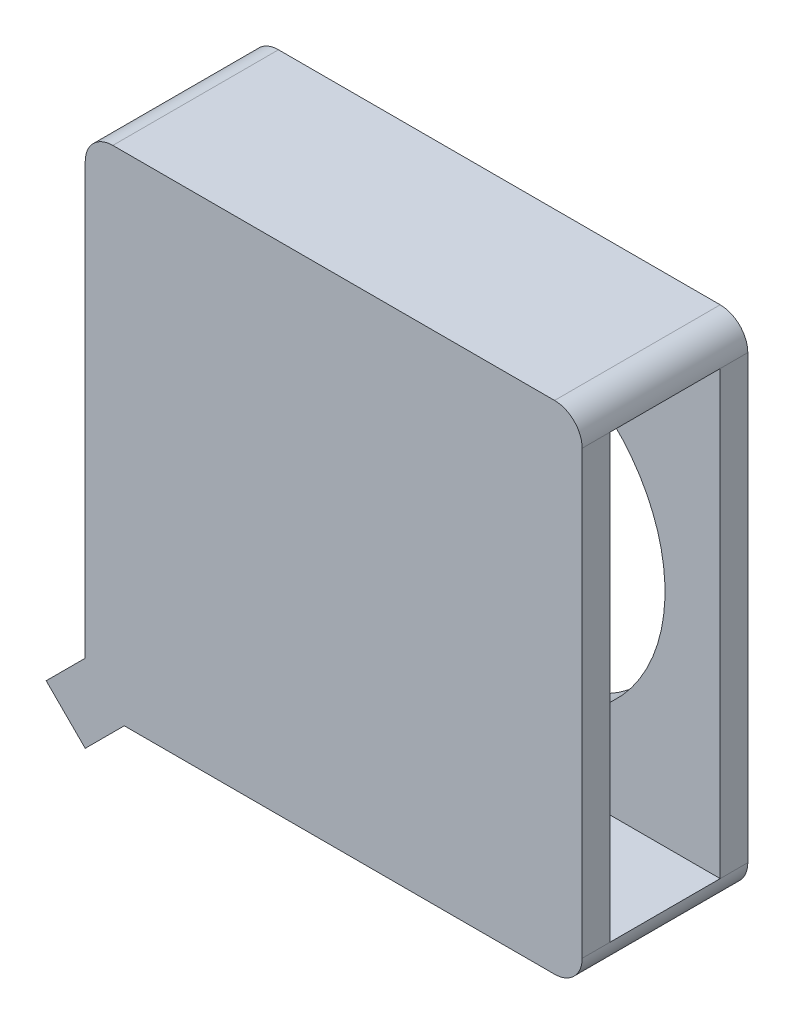
ISO-10303-21;
HEADER;
FILE_DESCRIPTION(('STEP AP214'),'2;1');
FILE_NAME('part.step','',(''),(''),'','','');
FILE_SCHEMA(('AUTOMOTIVE_DESIGN { 1 0 10303 214 1 1 1 1 }'));
ENDSEC;
DATA;
#1=APPLICATION_CONTEXT('core data for automotive mechanical design processes');
#2=APPLICATION_PROTOCOL_DEFINITION('international standard','automotive_design',2000,#1);
#3=PRODUCT_CONTEXT('',#1,'mechanical');
#4=PRODUCT('Part','Part','',(#3));
#5=PRODUCT_RELATED_PRODUCT_CATEGORY('part','',(#4));
#6=PRODUCT_DEFINITION_FORMATION('','',#4);
#7=PRODUCT_DEFINITION_CONTEXT('part definition',#1,'design');
#8=PRODUCT_DEFINITION('design','',#6,#7);
#9=PRODUCT_DEFINITION_SHAPE('','',#8);
#10=(LENGTH_UNIT() NAMED_UNIT(*) SI_UNIT(.MILLI.,.METRE.));
#11=(NAMED_UNIT(*) PLANE_ANGLE_UNIT() SI_UNIT($,.RADIAN.));
#12=(NAMED_UNIT(*) SI_UNIT($,.STERADIAN.) SOLID_ANGLE_UNIT());
#13=UNCERTAINTY_MEASURE_WITH_UNIT(LENGTH_MEASURE(1.E-05),#10,'distance_accuracy_value','');
#14=(GEOMETRIC_REPRESENTATION_CONTEXT(3) GLOBAL_UNCERTAINTY_ASSIGNED_CONTEXT((#13)) GLOBAL_UNIT_ASSIGNED_CONTEXT((#10,
#11,#12)) REPRESENTATION_CONTEXT('',''));
#15=CARTESIAN_POINT('',(0.,0.,0.));
#16=DIRECTION('',(0.,0.,1.));
#17=DIRECTION('',(1.,0.,0.));
#18=AXIS2_PLACEMENT_3D('',#15,#16,#17);
#19=CARTESIAN_POINT('',(4.78405315614618,2.67607973421927,3.));
#20=DIRECTION('',(-1.,0.,0.));
#21=DIRECTION('',(0.,0.,1.));
#22=AXIS2_PLACEMENT_3D('',#19,#20,#21);
#23=PLANE('',#22);
#24=DIRECTION('',(0.,0.,-1.));
#25=VECTOR('',#24,1.);
#26=CARTESIAN_POINT('',(4.78405315614618,-5.82392026578073,3.));
#27=LINE('',#26,#25);
#28=CARTESIAN_POINT('',(4.78405315614618,-5.82392026578073,3.));
#29=VERTEX_POINT('',#28);
#30=CARTESIAN_POINT('',(4.78405315614618,-5.82392026578073,2.5));
#31=VERTEX_POINT('',#30);
#32=EDGE_CURVE('E11',#29,#31,#27,.T.);
#33=ORIENTED_EDGE('',*,*,#32,.T.);
#34=DIRECTION('',(0.,-1.,0.));
#35=VECTOR('',#34,1.);
#36=CARTESIAN_POINT('',(4.78405315614618,-5.82392026578073,2.5));
#37=LINE('',#36,#35);
#38=CARTESIAN_POINT('',(4.78405315614618,2.17607973421927,2.5));
#39=VERTEX_POINT('',#38);
#40=EDGE_CURVE('E245',#39,#31,#37,.T.);
#41=ORIENTED_EDGE('',*,*,#40,.F.);
#42=DIRECTION('',(0.,0.,-1.));
#43=VECTOR('',#42,1.);
#44=CARTESIAN_POINT('',(4.78405315614618,2.17607973421927,3.));
#45=LINE('',#44,#43);
#46=CARTESIAN_POINT('',(4.78405315614618,2.17607973421927,3.));
#47=VERTEX_POINT('',#46);
#48=EDGE_CURVE('E231',#39,#47,#45,.F.);
#49=ORIENTED_EDGE('',*,*,#48,.T.);
#50=DIRECTION('',(0.,1.,0.));
#51=VECTOR('',#50,1.);
#52=CARTESIAN_POINT('',(4.78405315614618,2.67607973421927,3.));
#53=LINE('',#52,#51);
#54=EDGE_CURVE('E171',#29,#47,#53,.T.);
#55=ORIENTED_EDGE('',*,*,#54,.F.);
#56=EDGE_LOOP('',(#33,#41,#49,#55));
#57=FACE_BOUND('',#56,.T.);
#58=ADVANCED_FACE('F39',(#57),#23,.F.);
#59=CARTESIAN_POINT('',(-4.21594684385382,2.67607973421927,3.));
#60=DIRECTION('',(1.,0.,0.));
#61=DIRECTION('',(0.,1.,0.));
#62=AXIS2_PLACEMENT_3D('',#59,#60,#61);
#63=PLANE('',#62);
#64=DIRECTION('',(0.,-1.,0.));
#65=VECTOR('',#64,1.);
#66=CARTESIAN_POINT('',(-4.21594684385382,2.67607973421927,0.));
#67=LINE('',#66,#65);
#68=CARTESIAN_POINT('',(-4.21594684385382,2.17607973421927,0.));
#69=VERTEX_POINT('',#68);
#70=CARTESIAN_POINT('',(-4.21594684385382,-5.61681348459418,0.));
#71=VERTEX_POINT('',#70);
#72=EDGE_CURVE('E186',#69,#71,#67,.T.);
#73=ORIENTED_EDGE('',*,*,#72,.T.);
#74=DIRECTION('',(0.,0.,-1.));
#75=VECTOR('',#74,1.);
#76=CARTESIAN_POINT('',(-4.21594684385382,-5.61681348459418,5.));
#77=LINE('',#76,#75);
#78=CARTESIAN_POINT('',(-4.21594684385382,-5.61681348459418,3.));
#79=VERTEX_POINT('',#78);
#80=EDGE_CURVE('E266',#79,#71,#77,.T.);
#81=ORIENTED_EDGE('',*,*,#80,.F.);
#82=DIRECTION('',(0.,-1.,0.));
#83=VECTOR('',#82,1.);
#84=CARTESIAN_POINT('',(-4.21594684385382,2.67607973421927,3.));
#85=LINE('',#84,#83);
#86=CARTESIAN_POINT('',(-4.21594684385382,2.17607973421927,3.));
#87=VERTEX_POINT('',#86);
#88=EDGE_CURVE('E172',#87,#79,#85,.T.);
#89=ORIENTED_EDGE('',*,*,#88,.F.);
#90=DIRECTION('',(0.,0.,-1.));
#91=VECTOR('',#90,1.);
#92=CARTESIAN_POINT('',(-4.21594684385382,2.17607973421927,3.));
#93=LINE('',#92,#91);
#94=EDGE_CURVE('E212',#87,#69,#93,.T.);
#95=ORIENTED_EDGE('',*,*,#94,.T.);
#96=EDGE_LOOP('',(#73,#81,#89,#95));
#97=FACE_BOUND('',#96,.T.);
#98=ADVANCED_FACE('F264',(#97),#63,.F.);
#99=CARTESIAN_POINT('',(-4.21594684385382,-6.32392026578073,3.));
#100=DIRECTION('',(0.,1.,0.));
#101=DIRECTION('',(0.,0.,1.));
#102=AXIS2_PLACEMENT_3D('',#99,#100,#101);
#103=PLANE('',#102);
#104=DIRECTION('',(1.,0.,0.));
#105=VECTOR('',#104,1.);
#106=CARTESIAN_POINT('',(-4.21594684385382,-6.32392026578073,3.));
#107=LINE('',#106,#105);
#108=CARTESIAN_POINT('',(-3.50884006266727,-6.32392026578073,3.));
#109=VERTEX_POINT('',#108);
#110=CARTESIAN_POINT('',(4.28405315614618,-6.32392026578073,3.));
#111=VERTEX_POINT('',#110);
#112=EDGE_CURVE('E147',#109,#111,#107,.T.);
#113=ORIENTED_EDGE('',*,*,#112,.F.);
#114=DIRECTION('',(0.,0.,-1.));
#115=VECTOR('',#114,1.);
#116=CARTESIAN_POINT('',(-3.50884006266727,-6.32392026578073,5.));
#117=LINE('',#116,#115);
#118=CARTESIAN_POINT('',(-3.50884006266727,-6.32392026578073,0.));
#119=VERTEX_POINT('',#118);
#120=EDGE_CURVE('E155',#109,#119,#117,.T.);
#121=ORIENTED_EDGE('',*,*,#120,.T.);
#122=DIRECTION('',(1.,0.,0.));
#123=VECTOR('',#122,1.);
#124=CARTESIAN_POINT('',(-4.21594684385382,-6.32392026578073,0.));
#125=LINE('',#124,#123);
#126=CARTESIAN_POINT('',(4.28405315614618,-6.32392026578073,0.));
#127=VERTEX_POINT('',#126);
#128=EDGE_CURVE('E190',#119,#127,#125,.T.);
#129=ORIENTED_EDGE('',*,*,#128,.T.);
#130=DIRECTION('',(0.,0.,-1.));
#131=VECTOR('',#130,1.);
#132=CARTESIAN_POINT('',(4.28405315614618,-6.32392026578073,3.));
#133=LINE('',#132,#131);
#134=EDGE_CURVE('E168',#127,#111,#133,.F.);
#135=ORIENTED_EDGE('',*,*,#134,.T.);
#136=EDGE_LOOP('',(#113,#121,#129,#135));
#137=FACE_BOUND('',#136,.T.);
#138=ADVANCED_FACE('F166',(#137),#103,.F.);
#139=CARTESIAN_POINT('',(4.78405315614618,2.17607973421927,0.));
#140=VERTEX_POINT('',#139);
#141=CARTESIAN_POINT('',(4.78405315614618,2.17607973421927,0.5));
#142=VERTEX_POINT('',#141);
#143=EDGE_CURVE('E232',#140,#142,#45,.F.);
#144=ORIENTED_EDGE('',*,*,#143,.T.);
#145=DIRECTION('',(0.,1.,0.));
#146=VECTOR('',#145,1.);
#147=CARTESIAN_POINT('',(4.78405315614618,-5.82392026578073,0.5));
#148=LINE('',#147,#146);
#149=CARTESIAN_POINT('',(4.78405315614618,-5.82392026578073,0.5));
#150=VERTEX_POINT('',#149);
#151=EDGE_CURVE('E56',#150,#142,#148,.T.);
#152=ORIENTED_EDGE('',*,*,#151,.F.);
#153=CARTESIAN_POINT('',(4.78405315614618,-5.82392026578073,0.));
#154=VERTEX_POINT('',#153);
#155=EDGE_CURVE('E49',#150,#154,#27,.T.);
#156=ORIENTED_EDGE('',*,*,#155,.T.);
#157=DIRECTION('',(0.,1.,0.));
#158=VECTOR('',#157,1.);
#159=CARTESIAN_POINT('',(4.78405315614618,2.67607973421927,0.));
#160=LINE('',#159,#158);
#161=EDGE_CURVE('E194',#154,#140,#160,.T.);
#162=ORIENTED_EDGE('',*,*,#161,.T.);
#163=EDGE_LOOP('',(#144,#152,#156,#162));
#164=FACE_BOUND('',#163,.T.);
#165=ADVANCED_FACE('F354',(#164),#23,.F.);
#166=CARTESIAN_POINT('',(-4.21594684385382,2.67607973421927,3.));
#167=DIRECTION('',(0.,-1.,0.));
#168=DIRECTION('',(0.,0.,-1.));
#169=AXIS2_PLACEMENT_3D('',#166,#167,#168);
#170=PLANE('',#169);
#171=DIRECTION('',(-1.,0.,0.));
#172=VECTOR('',#171,1.);
#173=CARTESIAN_POINT('',(-4.21594684385382,2.67607973421927,0.));
#174=LINE('',#173,#172);
#175=CARTESIAN_POINT('',(4.28405315614618,2.67607973421927,0.));
#176=VERTEX_POINT('',#175);
#177=CARTESIAN_POINT('',(-3.71594684385382,2.67607973421927,0.));
#178=VERTEX_POINT('',#177);
#179=EDGE_CURVE('E180',#176,#178,#174,.T.);
#180=ORIENTED_EDGE('',*,*,#179,.T.);
#181=DIRECTION('',(0.,0.,-1.));
#182=VECTOR('',#181,1.);
#183=CARTESIAN_POINT('',(-3.71594684385382,2.67607973421927,3.));
#184=LINE('',#183,#182);
#185=CARTESIAN_POINT('',(-3.71594684385382,2.67607973421927,3.));
#186=VERTEX_POINT('',#185);
#187=EDGE_CURVE('E64',#178,#186,#184,.F.);
#188=ORIENTED_EDGE('',*,*,#187,.T.);
#189=DIRECTION('',(-1.,0.,0.));
#190=VECTOR('',#189,1.);
#191=CARTESIAN_POINT('',(-4.21594684385382,2.67607973421927,3.));
#192=LINE('',#191,#190);
#193=CARTESIAN_POINT('',(4.28405315614618,2.67607973421927,3.));
#194=VERTEX_POINT('',#193);
#195=EDGE_CURVE('E177',#194,#186,#192,.T.);
#196=ORIENTED_EDGE('',*,*,#195,.F.);
#197=DIRECTION('',(0.,0.,-1.));
#198=VECTOR('',#197,1.);
#199=CARTESIAN_POINT('',(4.28405315614618,2.67607973421927,3.));
#200=LINE('',#199,#198);
#201=EDGE_CURVE('E225',#194,#176,#200,.T.);
#202=ORIENTED_EDGE('',*,*,#201,.T.);
#203=EDGE_LOOP('',(#180,#188,#196,#202));
#204=FACE_BOUND('',#203,.T.);
#205=ADVANCED_FACE('F251',(#204),#170,.F.);
#206=CARTESIAN_POINT('',(0.,0.,3.));
#207=DIRECTION('',(0.,0.,1.));
#208=DIRECTION('',(1.,0.,0.));
#209=AXIS2_PLACEMENT_3D('',#206,#207,#208);
#210=PLANE('',#209);
#211=DIRECTION('',(-0.707106781186548,-0.707106781186547,0.));
#212=VECTOR('',#211,1.);
#213=CARTESIAN_POINT('',(-4.21594684385382,-7.03102704696728,3.));
#214=LINE('',#213,#212);
#215=CARTESIAN_POINT('',(-4.21594684385382,-7.03102704696728,3.));
#216=VERTEX_POINT('',#215);
#217=EDGE_CURVE('E143',#109,#216,#214,.T.);
#218=ORIENTED_EDGE('',*,*,#217,.F.);
#219=ORIENTED_EDGE('',*,*,#112,.T.);
#220=CARTESIAN_POINT('',(4.28405315614618,-5.82392026578073,3.));
#221=DIRECTION('',(0.,0.,1.));
#222=DIRECTION('',(1.,0.,0.));
#223=AXIS2_PLACEMENT_3D('',#220,#221,#222);
#224=CIRCLE('',#223,0.5);
#225=EDGE_CURVE('E219',#111,#29,#224,.T.);
#226=ORIENTED_EDGE('',*,*,#225,.T.);
#227=ORIENTED_EDGE('',*,*,#54,.T.);
#228=CARTESIAN_POINT('',(4.28405315614618,2.17607973421927,3.));
#229=DIRECTION('',(0.,0.,1.));
#230=DIRECTION('',(1.,0.,0.));
#231=AXIS2_PLACEMENT_3D('',#228,#229,#230);
#232=CIRCLE('',#231,0.5);
#233=EDGE_CURVE('E216',#47,#194,#232,.T.);
#234=ORIENTED_EDGE('',*,*,#233,.T.);
#235=ORIENTED_EDGE('',*,*,#195,.T.);
#236=CARTESIAN_POINT('',(-3.71594684385382,2.17607973421927,3.));
#237=DIRECTION('',(0.,0.,1.));
#238=DIRECTION('',(1.,0.,0.));
#239=AXIS2_PLACEMENT_3D('',#236,#237,#238);
#240=CIRCLE('',#239,0.5);
#241=EDGE_CURVE('E222',#186,#87,#240,.T.);
#242=ORIENTED_EDGE('',*,*,#241,.T.);
#243=ORIENTED_EDGE('',*,*,#88,.T.);
#244=DIRECTION('',(0.707106781186548,0.707106781186547,0.));
#245=VECTOR('',#244,1.);
#246=CARTESIAN_POINT('',(-4.21594684385382,-5.61681348459418,3.));
#247=LINE('',#246,#245);
#248=CARTESIAN_POINT('',(-4.92305362504037,-6.32392026578073,3.));
#249=VERTEX_POINT('',#248);
#250=EDGE_CURVE('E267',#249,#79,#247,.T.);
#251=ORIENTED_EDGE('',*,*,#250,.F.);
#252=DIRECTION('',(-0.707106781186548,0.707106781186548,0.));
#253=VECTOR('',#252,1.);
#254=CARTESIAN_POINT('',(-4.92305362504037,-6.32392026578073,3.));
#255=LINE('',#254,#253);
#256=EDGE_CURVE('E150',#216,#249,#255,.T.);
#257=ORIENTED_EDGE('',*,*,#256,.F.);
#258=EDGE_LOOP('',(#218,#219,#226,#227,#234,#235,#242,#243,#251,#257));
#259=FACE_BOUND('',#258,.T.);
#260=ADVANCED_FACE('F145',(#259),#210,.T.);
#261=CARTESIAN_POINT('',(0.,0.,0.));
#262=DIRECTION('',(0.,0.,1.));
#263=DIRECTION('',(1.,0.,0.));
#264=AXIS2_PLACEMENT_3D('',#261,#262,#263);
#265=PLANE('',#264);
#266=ORIENTED_EDGE('',*,*,#128,.F.);
#267=DIRECTION('',(-0.707106781186548,-0.707106781186547,0.));
#268=VECTOR('',#267,1.);
#269=CARTESIAN_POINT('',(-4.21594684385382,-7.03102704696728,0.));
#270=LINE('',#269,#268);
#271=CARTESIAN_POINT('',(-4.21594684385382,-7.03102704696728,0.));
#272=VERTEX_POINT('',#271);
#273=EDGE_CURVE('E160',#119,#272,#270,.T.);
#274=ORIENTED_EDGE('',*,*,#273,.T.);
#275=DIRECTION('',(-0.707106781186547,0.707106781186547,0.));
#276=VECTOR('',#275,1.);
#277=CARTESIAN_POINT('',(-4.92305362504037,-6.32392026578073,0.));
#278=LINE('',#277,#276);
#279=CARTESIAN_POINT('',(-4.92305362504037,-6.32392026578073,0.));
#280=VERTEX_POINT('',#279);
#281=EDGE_CURVE('E164',#272,#280,#278,.T.);
#282=ORIENTED_EDGE('',*,*,#281,.T.);
#283=DIRECTION('',(0.707106781186548,0.707106781186547,0.));
#284=VECTOR('',#283,1.);
#285=CARTESIAN_POINT('',(-4.21594684385382,-5.61681348459418,0.));
#286=LINE('',#285,#284);
#287=EDGE_CURVE('E275',#280,#71,#286,.T.);
#288=ORIENTED_EDGE('',*,*,#287,.T.);
#289=ORIENTED_EDGE('',*,*,#72,.F.);
#290=CARTESIAN_POINT('',(-3.71594684385382,2.17607973421927,0.));
#291=DIRECTION('',(0.,0.,1.));
#292=DIRECTION('',(1.,0.,0.));
#293=AXIS2_PLACEMENT_3D('',#290,#291,#292);
#294=CIRCLE('',#293,0.5);
#295=EDGE_CURVE('E209',#69,#178,#294,.F.);
#296=ORIENTED_EDGE('',*,*,#295,.T.);
#297=ORIENTED_EDGE('',*,*,#179,.F.);
#298=CARTESIAN_POINT('',(4.28405315614618,2.17607973421927,0.));
#299=DIRECTION('',(0.,0.,1.));
#300=DIRECTION('',(1.,0.,0.));
#301=AXIS2_PLACEMENT_3D('',#298,#299,#300);
#302=CIRCLE('',#301,0.5);
#303=EDGE_CURVE('E202',#176,#140,#302,.F.);
#304=ORIENTED_EDGE('',*,*,#303,.T.);
#305=ORIENTED_EDGE('',*,*,#161,.F.);
#306=CARTESIAN_POINT('',(4.28405315614618,-5.82392026578073,0.));
#307=DIRECTION('',(0.,0.,1.));
#308=DIRECTION('',(1.,0.,0.));
#309=AXIS2_PLACEMENT_3D('',#306,#307,#308);
#310=CIRCLE('',#309,0.5);
#311=EDGE_CURVE('E205',#154,#127,#310,.F.);
#312=ORIENTED_EDGE('',*,*,#311,.T.);
#313=EDGE_LOOP('',(#266,#274,#282,#288,#289,#296,#297,#304,#305,#312));
#314=FACE_BOUND('',#313,.T.);
#315=CARTESIAN_POINT('',(0.784053156146182,-1.82392026578073,0.));
#316=DIRECTION('',(0.,0.,-1.));
#317=DIRECTION('',(-1.,0.,0.));
#318=AXIS2_PLACEMENT_3D('',#315,#316,#317);
#319=CIRCLE('',#318,3.);
#320=CARTESIAN_POINT('',(-2.21594684385382,-1.82392026578073,0.));
#321=VERTEX_POINT('',#320);
#322=EDGE_CURVE('E191',#321,#321,#319,.T.);
#323=ORIENTED_EDGE('',*,*,#322,.F.);
#324=EDGE_LOOP('',(#323));
#325=FACE_BOUND('',#324,.T.);
#326=ADVANCED_FACE('F253',(#314,#325),#265,.F.);
#327=CARTESIAN_POINT('',(-3.71594684385382,2.17607973421927,3.));
#328=DIRECTION('',(0.,0.,-1.));
#329=DIRECTION('',(-1.,0.,0.));
#330=AXIS2_PLACEMENT_3D('',#327,#328,#329);
#331=CYLINDRICAL_SURFACE('',#330,0.5);
#332=ORIENTED_EDGE('',*,*,#241,.F.);
#333=ORIENTED_EDGE('',*,*,#187,.F.);
#334=ORIENTED_EDGE('',*,*,#295,.F.);
#335=ORIENTED_EDGE('',*,*,#94,.F.);
#336=EDGE_LOOP('',(#332,#333,#334,#335));
#337=FACE_BOUND('',#336,.T.);
#338=ADVANCED_FACE('F261',(#337),#331,.T.);
#339=CARTESIAN_POINT('',(4.28405315614618,-5.82392026578073,3.));
#340=DIRECTION('',(0.,0.,-1.));
#341=DIRECTION('',(-1.,0.,0.));
#342=AXIS2_PLACEMENT_3D('',#339,#340,#341);
#343=CYLINDRICAL_SURFACE('',#342,0.5);
#344=ORIENTED_EDGE('',*,*,#225,.F.);
#345=ORIENTED_EDGE('',*,*,#134,.F.);
#346=ORIENTED_EDGE('',*,*,#311,.F.);
#347=ORIENTED_EDGE('',*,*,#155,.F.);
#348=DIRECTION('',(0.,0.,-1.));
#349=VECTOR('',#348,1.);
#350=CARTESIAN_POINT('',(4.78405315614618,-5.82392026578073,2.5));
#351=LINE('',#350,#349);
#352=EDGE_CURVE('E290',#31,#150,#351,.T.);
#353=ORIENTED_EDGE('',*,*,#352,.F.);
#354=ORIENTED_EDGE('',*,*,#32,.F.);
#355=EDGE_LOOP('',(#344,#345,#346,#347,#353,#354));
#356=FACE_BOUND('',#355,.T.);
#357=ADVANCED_FACE('F370',(#356),#343,.T.);
#358=CARTESIAN_POINT('',(4.28405315614618,2.17607973421927,3.));
#359=DIRECTION('',(0.,0.,-1.));
#360=DIRECTION('',(-1.,0.,0.));
#361=AXIS2_PLACEMENT_3D('',#358,#359,#360);
#362=CYLINDRICAL_SURFACE('',#361,0.5);
#363=ORIENTED_EDGE('',*,*,#233,.F.);
#364=ORIENTED_EDGE('',*,*,#48,.F.);
#365=DIRECTION('',(0.,0.,1.));
#366=VECTOR('',#365,1.);
#367=CARTESIAN_POINT('',(4.78405315614618,2.17607973421927,2.5));
#368=LINE('',#367,#366);
#369=EDGE_CURVE('E313',#142,#39,#368,.T.);
#370=ORIENTED_EDGE('',*,*,#369,.F.);
#371=ORIENTED_EDGE('',*,*,#143,.F.);
#372=ORIENTED_EDGE('',*,*,#303,.F.);
#373=ORIENTED_EDGE('',*,*,#201,.F.);
#374=EDGE_LOOP('',(#363,#364,#370,#371,#372,#373));
#375=FACE_BOUND('',#374,.T.);
#376=ADVANCED_FACE('F41',(#375),#362,.T.);
#377=CARTESIAN_POINT('',(0.784053156146182,-1.82392026578073,2.5));
#378=DIRECTION('',(0.,0.,-1.));
#379=DIRECTION('',(-1.,0.,0.));
#380=AXIS2_PLACEMENT_3D('',#377,#378,#379);
#381=CYLINDRICAL_SURFACE('',#380,3.);
#382=CARTESIAN_POINT('',(0.784053156146182,-1.82392026578073,0.5));
#383=DIRECTION('',(0.,0.,-1.));
#384=DIRECTION('',(-1.,0.,0.));
#385=AXIS2_PLACEMENT_3D('',#382,#383,#384);
#386=CIRCLE('',#385,3.);
#387=CARTESIAN_POINT('',(-2.21594684385382,-1.82392026578073,0.5));
#388=VERTEX_POINT('',#387);
#389=EDGE_CURVE('E43',#388,#388,#386,.F.);
#390=ORIENTED_EDGE('',*,*,#389,.T.);
#391=EDGE_LOOP('',(#390));
#392=FACE_BOUND('',#391,.T.);
#393=ORIENTED_EDGE('',*,*,#322,.T.);
#394=EDGE_LOOP('',(#393));
#395=FACE_BOUND('',#394,.T.);
#396=ADVANCED_FACE('F337',(#392,#395),#381,.F.);
#397=CARTESIAN_POINT('',(-3.71594684385382,-5.82392026578073,0.5));
#398=DIRECTION('',(0.,0.,-1.));
#399=DIRECTION('',(-1.,0.,0.));
#400=AXIS2_PLACEMENT_3D('',#397,#398,#399);
#401=PLANE('',#400);
#402=ORIENTED_EDGE('',*,*,#151,.T.);
#403=DIRECTION('',(1.,0.,0.));
#404=VECTOR('',#403,1.);
#405=CARTESIAN_POINT('',(-3.71594684385382,2.17607973421927,0.5));
#406=LINE('',#405,#404);
#407=CARTESIAN_POINT('',(-3.71594684385382,2.17607973421927,0.5));
#408=VERTEX_POINT('',#407);
#409=EDGE_CURVE('E325',#408,#142,#406,.T.);
#410=ORIENTED_EDGE('',*,*,#409,.F.);
#411=DIRECTION('',(0.,1.,0.));
#412=VECTOR('',#411,1.);
#413=CARTESIAN_POINT('',(-3.71594684385382,-5.82392026578073,0.5));
#414=LINE('',#413,#412);
#415=CARTESIAN_POINT('',(-3.71594684385382,-5.82392026578073,0.5));
#416=VERTEX_POINT('',#415);
#417=EDGE_CURVE('E295',#416,#408,#414,.T.);
#418=ORIENTED_EDGE('',*,*,#417,.F.);
#419=DIRECTION('',(1.,0.,0.));
#420=VECTOR('',#419,1.);
#421=CARTESIAN_POINT('',(-3.71594684385382,-5.82392026578073,0.5));
#422=LINE('',#421,#420);
#423=EDGE_CURVE('E307',#416,#150,#422,.T.);
#424=ORIENTED_EDGE('',*,*,#423,.T.);
#425=EDGE_LOOP('',(#402,#410,#418,#424));
#426=FACE_BOUND('',#425,.T.);
#427=ORIENTED_EDGE('',*,*,#389,.F.);
#428=EDGE_LOOP('',(#427));
#429=FACE_BOUND('',#428,.T.);
#430=ADVANCED_FACE('F339',(#426,#429),#401,.F.);
#431=CARTESIAN_POINT('',(-3.71594684385382,-5.82392026578073,2.5));
#432=DIRECTION('',(0.,-1.,0.));
#433=DIRECTION('',(0.,0.,-1.));
#434=AXIS2_PLACEMENT_3D('',#431,#432,#433);
#435=PLANE('',#434);
#436=ORIENTED_EDGE('',*,*,#352,.T.);
#437=ORIENTED_EDGE('',*,*,#423,.F.);
#438=DIRECTION('',(0.,0.,-1.));
#439=VECTOR('',#438,1.);
#440=CARTESIAN_POINT('',(-3.71594684385382,-5.82392026578073,2.5));
#441=LINE('',#440,#439);
#442=CARTESIAN_POINT('',(-3.71594684385382,-5.82392026578073,2.5));
#443=VERTEX_POINT('',#442);
#444=EDGE_CURVE('E291',#443,#416,#441,.T.);
#445=ORIENTED_EDGE('',*,*,#444,.F.);
#446=DIRECTION('',(1.,0.,0.));
#447=VECTOR('',#446,1.);
#448=CARTESIAN_POINT('',(-3.71594684385382,-5.82392026578073,2.5));
#449=LINE('',#448,#447);
#450=EDGE_CURVE('E319',#443,#31,#449,.T.);
#451=ORIENTED_EDGE('',*,*,#450,.T.);
#452=EDGE_LOOP('',(#436,#437,#445,#451));
#453=FACE_BOUND('',#452,.T.);
#454=ADVANCED_FACE('F341',(#453),#435,.F.);
#455=CARTESIAN_POINT('',(-3.71594684385382,2.17607973421927,2.5));
#456=DIRECTION('',(0.,1.,0.));
#457=DIRECTION('',(0.,0.,1.));
#458=AXIS2_PLACEMENT_3D('',#455,#456,#457);
#459=PLANE('',#458);
#460=ORIENTED_EDGE('',*,*,#369,.T.);
#461=DIRECTION('',(1.,0.,0.));
#462=VECTOR('',#461,1.);
#463=CARTESIAN_POINT('',(-3.71594684385382,2.17607973421927,2.5));
#464=LINE('',#463,#462);
#465=CARTESIAN_POINT('',(-3.71594684385382,2.17607973421927,2.5));
#466=VERTEX_POINT('',#465);
#467=EDGE_CURVE('E322',#466,#39,#464,.T.);
#468=ORIENTED_EDGE('',*,*,#467,.F.);
#469=DIRECTION('',(0.,0.,1.));
#470=VECTOR('',#469,1.);
#471=CARTESIAN_POINT('',(-3.71594684385382,2.17607973421927,2.5));
#472=LINE('',#471,#470);
#473=EDGE_CURVE('E299',#408,#466,#472,.T.);
#474=ORIENTED_EDGE('',*,*,#473,.F.);
#475=ORIENTED_EDGE('',*,*,#409,.T.);
#476=EDGE_LOOP('',(#460,#468,#474,#475));
#477=FACE_BOUND('',#476,.T.);
#478=ADVANCED_FACE('F347',(#477),#459,.F.);
#479=CARTESIAN_POINT('',(-3.71594684385382,0.,0.));
#480=DIRECTION('',(1.,0.,0.));
#481=DIRECTION('',(0.,0.,-1.));
#482=AXIS2_PLACEMENT_3D('',#479,#480,#481);
#483=PLANE('',#482);
#484=ORIENTED_EDGE('',*,*,#444,.T.);
#485=ORIENTED_EDGE('',*,*,#417,.T.);
#486=ORIENTED_EDGE('',*,*,#473,.T.);
#487=DIRECTION('',(0.,-1.,0.));
#488=VECTOR('',#487,1.);
#489=CARTESIAN_POINT('',(-3.71594684385382,-5.82392026578073,2.5));
#490=LINE('',#489,#488);
#491=EDGE_CURVE('E303',#466,#443,#490,.T.);
#492=ORIENTED_EDGE('',*,*,#491,.T.);
#493=EDGE_LOOP('',(#484,#485,#486,#492));
#494=FACE_BOUND('',#493,.T.);
#495=ADVANCED_FACE('F389',(#494),#483,.T.);
#496=CARTESIAN_POINT('',(0.784053156146182,-1.82392026578073,2.5));
#497=DIRECTION('',(0.,0.,-1.));
#498=DIRECTION('',(-1.,0.,0.));
#499=AXIS2_PLACEMENT_3D('',#496,#497,#498);
#500=PLANE('',#499);
#501=ORIENTED_EDGE('',*,*,#40,.T.);
#502=ORIENTED_EDGE('',*,*,#450,.F.);
#503=ORIENTED_EDGE('',*,*,#491,.F.);
#504=ORIENTED_EDGE('',*,*,#467,.T.);
#505=EDGE_LOOP('',(#501,#502,#503,#504));
#506=FACE_BOUND('',#505,.T.);
#507=ADVANCED_FACE('F392',(#506),#500,.T.);
#508=CARTESIAN_POINT('',(-4.21594684385382,-7.03102704696728,5.));
#509=DIRECTION('',(0.707106781186547,-0.707106781186548,0.));
#510=DIRECTION('',(0.707106781186548,0.707106781186547,0.));
#511=AXIS2_PLACEMENT_3D('',#508,#509,#510);
#512=PLANE('',#511);
#513=ORIENTED_EDGE('',*,*,#120,.F.);
#514=ORIENTED_EDGE('',*,*,#217,.T.);
#515=DIRECTION('',(0.,0.,-1.));
#516=VECTOR('',#515,1.);
#517=CARTESIAN_POINT('',(-4.21594684385382,-7.03102704696728,5.));
#518=LINE('',#517,#516);
#519=EDGE_CURVE('E154',#216,#272,#518,.T.);
#520=ORIENTED_EDGE('',*,*,#519,.T.);
#521=ORIENTED_EDGE('',*,*,#273,.F.);
#522=EDGE_LOOP('',(#513,#514,#520,#521));
#523=FACE_BOUND('',#522,.T.);
#524=ADVANCED_FACE('F158',(#523),#512,.T.);
#525=CARTESIAN_POINT('',(-4.92305362504037,-6.32392026578073,5.));
#526=DIRECTION('',(-0.707106781186548,-0.707106781186548,0.));
#527=DIRECTION('',(0.707106781186548,-0.707106781186548,0.));
#528=AXIS2_PLACEMENT_3D('',#525,#526,#527);
#529=PLANE('',#528);
#530=ORIENTED_EDGE('',*,*,#519,.F.);
#531=ORIENTED_EDGE('',*,*,#256,.T.);
#532=DIRECTION('',(0.,0.,-1.));
#533=VECTOR('',#532,1.);
#534=CARTESIAN_POINT('',(-4.92305362504037,-6.32392026578073,5.));
#535=LINE('',#534,#533);
#536=EDGE_CURVE('E271',#249,#280,#535,.T.);
#537=ORIENTED_EDGE('',*,*,#536,.T.);
#538=ORIENTED_EDGE('',*,*,#281,.F.);
#539=EDGE_LOOP('',(#530,#531,#537,#538));
#540=FACE_BOUND('',#539,.T.);
#541=ADVANCED_FACE('F281',(#540),#529,.T.);
#542=CARTESIAN_POINT('',(-4.21594684385382,-5.61681348459418,5.));
#543=DIRECTION('',(-0.707106781186547,0.707106781186548,0.));
#544=DIRECTION('',(-0.707106781186548,-0.707106781186547,0.));
#545=AXIS2_PLACEMENT_3D('',#542,#543,#544);
#546=PLANE('',#545);
#547=ORIENTED_EDGE('',*,*,#536,.F.);
#548=ORIENTED_EDGE('',*,*,#250,.T.);
#549=ORIENTED_EDGE('',*,*,#80,.T.);
#550=ORIENTED_EDGE('',*,*,#287,.F.);
#551=EDGE_LOOP('',(#547,#548,#549,#550));
#552=FACE_BOUND('',#551,.T.);
#553=ADVANCED_FACE('F274',(#552),#546,.T.);
#554=CLOSED_SHELL('',(#58,#98,#138,#165,#205,#260,#326,#338,#357,#376,#396,#430,#454,#478,#495,
#507,#524,#541,#553));
#555=MANIFOLD_SOLID_BREP('B2',#554);
#556=ADVANCED_BREP_SHAPE_REPRESENTATION('',(#18,#555),#14);
#557=SHAPE_DEFINITION_REPRESENTATION(#9,#556);
ENDSEC;
END-ISO-10303-21;
